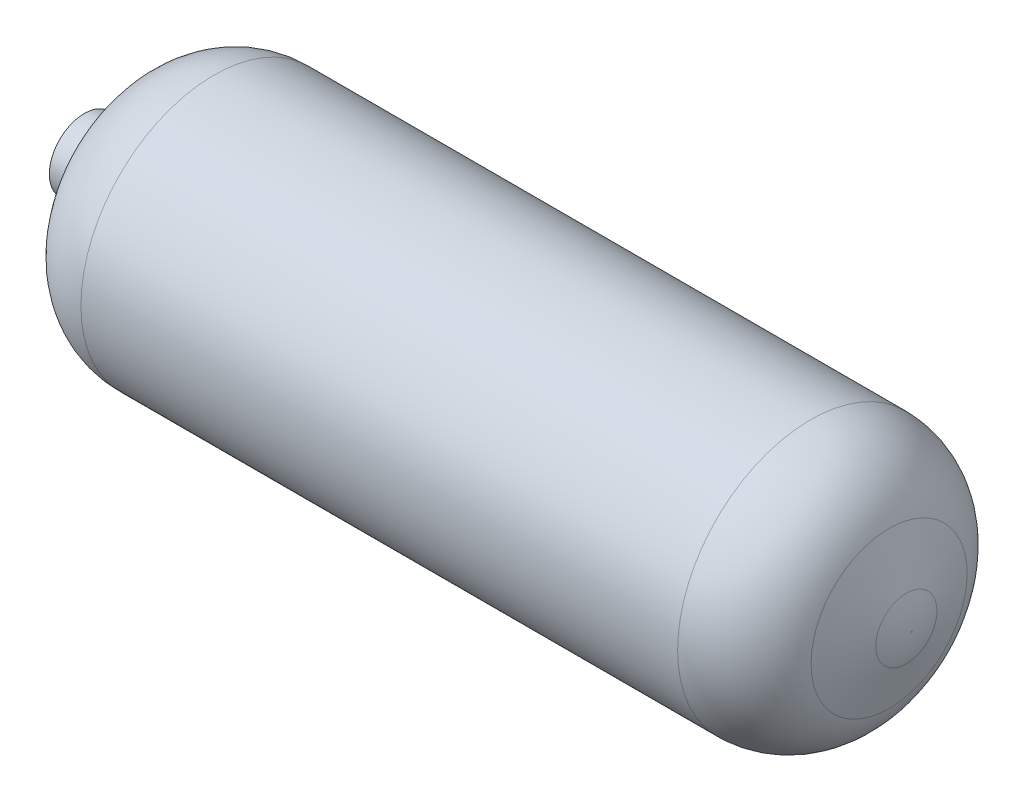
ISO-10303-21;
HEADER;
FILE_DESCRIPTION(('STEP AP214'),'2;1');
FILE_NAME('part.step','',(''),(''),'','','');
FILE_SCHEMA(('AUTOMOTIVE_DESIGN { 1 0 10303 214 1 1 1 1 }'));
ENDSEC;
DATA;
#1=APPLICATION_CONTEXT('core data for automotive mechanical design processes');
#2=APPLICATION_PROTOCOL_DEFINITION('international standard','automotive_design',2000,#1);
#3=PRODUCT_CONTEXT('',#1,'mechanical');
#4=PRODUCT('Part','Part','',(#3));
#5=PRODUCT_RELATED_PRODUCT_CATEGORY('part','',(#4));
#6=PRODUCT_DEFINITION_FORMATION('','',#4);
#7=PRODUCT_DEFINITION_CONTEXT('part definition',#1,'design');
#8=PRODUCT_DEFINITION('design','',#6,#7);
#9=PRODUCT_DEFINITION_SHAPE('','',#8);
#10=(LENGTH_UNIT() NAMED_UNIT(*) SI_UNIT(.MILLI.,.METRE.));
#11=(NAMED_UNIT(*) PLANE_ANGLE_UNIT() SI_UNIT($,.RADIAN.));
#12=(NAMED_UNIT(*) SI_UNIT($,.STERADIAN.) SOLID_ANGLE_UNIT());
#13=UNCERTAINTY_MEASURE_WITH_UNIT(LENGTH_MEASURE(1.E-05),#10,'distance_accuracy_value','');
#14=(GEOMETRIC_REPRESENTATION_CONTEXT(3) GLOBAL_UNCERTAINTY_ASSIGNED_CONTEXT((#13)) GLOBAL_UNIT_ASSIGNED_CONTEXT((#10,
#11,#12)) REPRESENTATION_CONTEXT('',''));
#15=CARTESIAN_POINT('',(0.,0.,0.));
#16=DIRECTION('',(0.,0.,1.));
#17=DIRECTION('',(1.,0.,0.));
#18=AXIS2_PLACEMENT_3D('',#15,#16,#17);
#19=CARTESIAN_POINT('',(-242.271269759622,0.,0.));
#20=DIRECTION('',(1.,0.,0.));
#21=DIRECTION('',(0.,0.,-1.));
#22=AXIS2_PLACEMENT_3D('',#19,#20,#21);
#23=CONICAL_SURFACE('',#22,23.866436766229,1.09955742875643);
#24=CARTESIAN_POINT('',(-226.546463052101,0.,0.));
#25=DIRECTION('',(-1.,0.,0.));
#26=DIRECTION('',(0.,0.,1.));
#27=AXIS2_PLACEMENT_3D('',#24,#25,#26);
#28=CIRCLE('',#27,54.7281076074481);
#29=CARTESIAN_POINT('',(-226.546463052101,0.,54.7281076074481));
#30=VERTEX_POINT('',#29);
#31=EDGE_CURVE('E103',#30,#30,#28,.T.);
#32=ORIENTED_EDGE('',*,*,#31,.T.);
#33=EDGE_LOOP('',(#32));
#34=FACE_BOUND('',#33,.T.);
#35=CARTESIAN_POINT('',(-242.271269759622,0.,0.));
#36=DIRECTION('',(-1.,0.,0.));
#37=DIRECTION('',(0.,0.,1.));
#38=AXIS2_PLACEMENT_3D('',#35,#36,#37);
#39=CIRCLE('',#38,23.866436766229);
#40=CARTESIAN_POINT('',(-242.271269759622,0.,23.866436766229));
#41=VERTEX_POINT('',#40);
#42=EDGE_CURVE('E54',#41,#41,#39,.T.);
#43=ORIENTED_EDGE('',*,*,#42,.F.);
#44=EDGE_LOOP('',(#43));
#45=FACE_BOUND('',#44,.T.);
#46=ADVANCED_FACE('F37',(#34,#45),#23,.T.);
#47=CARTESIAN_POINT('',(-245.166734472183,0.,0.));
#48=DIRECTION('',(-1.,0.,0.));
#49=DIRECTION('',(0.,0.,1.));
#50=AXIS2_PLACEMENT_3D('',#47,#48,#49);
#51=TOROIDAL_SURFACE('',#50,25.3417497253921,3.24965601705214);
#52=CARTESIAN_POINT('',(-245.166734472183,0.,0.));
#53=DIRECTION('',(-1.,0.,0.));
#54=DIRECTION('',(0.,0.,1.));
#55=AXIS2_PLACEMENT_3D('',#52,#53,#54);
#56=CIRCLE('',#55,22.09209370834);
#57=CARTESIAN_POINT('',(-245.166734472183,0.,22.09209370834));
#58=VERTEX_POINT('',#57);
#59=EDGE_CURVE('E78',#58,#58,#56,.T.);
#60=ORIENTED_EDGE('',*,*,#59,.F.);
#61=EDGE_LOOP('',(#60));
#62=FACE_BOUND('',#61,.T.);
#63=ORIENTED_EDGE('',*,*,#42,.T.);
#64=EDGE_LOOP('',(#63));
#65=FACE_BOUND('',#64,.T.);
#66=ADVANCED_FACE('F127',(#62,#65),#51,.F.);
#67=CARTESIAN_POINT('',(-260.719194131512,0.,0.));
#68=DIRECTION('',(-1.,0.,0.));
#69=DIRECTION('',(0.,0.,1.));
#70=AXIS2_PLACEMENT_3D('',#67,#68,#69);
#71=CYLINDRICAL_SURFACE('',#70,22.09209370834);
#72=ORIENTED_EDGE('',*,*,#59,.T.);
#73=EDGE_LOOP('',(#72));
#74=FACE_BOUND('',#73,.T.);
#75=CARTESIAN_POINT('',(-260.719194131512,0.,0.));
#76=DIRECTION('',(-1.,0.,0.));
#77=DIRECTION('',(0.,0.,1.));
#78=AXIS2_PLACEMENT_3D('',#75,#76,#77);
#79=CIRCLE('',#78,22.09209370834);
#80=CARTESIAN_POINT('',(-260.719194131512,0.,22.09209370834));
#81=VERTEX_POINT('',#80);
#82=EDGE_CURVE('E82',#81,#81,#79,.T.);
#83=ORIENTED_EDGE('',*,*,#82,.F.);
#84=EDGE_LOOP('',(#83));
#85=FACE_BOUND('',#84,.T.);
#86=ADVANCED_FACE('F132',(#74,#85),#71,.T.);
#87=CARTESIAN_POINT('',(-260.719194131512,0.,0.));
#88=DIRECTION('',(1.,0.,0.));
#89=DIRECTION('',(0.,0.,-1.));
#90=AXIS2_PLACEMENT_3D('',#87,#88,#89);
#91=PLANE('',#90);
#92=ORIENTED_EDGE('',*,*,#82,.T.);
#93=EDGE_LOOP('',(#92));
#94=FACE_BOUND('',#93,.T.);
#95=ADVANCED_FACE('F277',(#94),#91,.F.);
#96=CARTESIAN_POINT('',(260.719194131512,0.,0.));
#97=DIRECTION('',(-1.,0.,0.));
#98=DIRECTION('',(0.,0.,1.));
#99=AXIS2_PLACEMENT_3D('',#96,#97,#98);
#100=PLANE('',#99);
#101=CARTESIAN_POINT('',(260.719194131512,0.,0.));
#102=DIRECTION('',(-1.,0.,0.));
#103=DIRECTION('',(0.,0.,1.));
#104=AXIS2_PLACEMENT_3D('',#101,#102,#103);
#105=CIRCLE('',#104,0.381787731454405);
#106=CARTESIAN_POINT('',(260.719194131512,0.,0.381787731454405));
#107=VERTEX_POINT('',#106);
#108=EDGE_CURVE('E86',#107,#107,#105,.T.);
#109=ORIENTED_EDGE('',*,*,#108,.F.);
#110=EDGE_LOOP('',(#109));
#111=FACE_BOUND('',#110,.T.);
#112=ADVANCED_FACE('F267',(#111),#100,.F.);
#113=CARTESIAN_POINT('',(205.488959860663,0.,0.));
#114=DIRECTION('',(-1.,0.,0.));
#115=DIRECTION('',(0.,0.,1.));
#116=AXIS2_PLACEMENT_3D('',#113,#114,#115);
#117=DEGENERATE_TOROIDAL_SURFACE('',#116,0.381787731454405,55.23023427085,.T.);
#118=CARTESIAN_POINT('',(257.388403449257,0.,0.));
#119=DIRECTION('',(-1.,0.,0.));
#120=DIRECTION('',(0.,0.,1.));
#121=AXIS2_PLACEMENT_3D('',#118,#119,#120);
#122=CIRCLE('',#121,19.2716403726806);
#123=CARTESIAN_POINT('',(257.388403449257,0.,19.2716403726806));
#124=VERTEX_POINT('',#123);
#125=EDGE_CURVE('E91',#124,#124,#122,.T.);
#126=ORIENTED_EDGE('',*,*,#125,.F.);
#127=EDGE_LOOP('',(#126));
#128=FACE_BOUND('',#127,.T.);
#129=ORIENTED_EDGE('',*,*,#108,.T.);
#130=EDGE_LOOP('',(#129));
#131=FACE_BOUND('',#130,.T.);
#132=ADVANCED_FACE('F257',(#128,#131),#117,.T.);
#133=CARTESIAN_POINT('',(246.499099686017,0.,0.));
#134=DIRECTION('',(-1.,0.,0.));
#135=DIRECTION('',(0.,0.,1.));
#136=AXIS2_PLACEMENT_3D('',#133,#134,#135);
#137=CONICAL_SURFACE('',#136,49.1897565757662,1.22173047639603);
#138=ORIENTED_EDGE('',*,*,#125,.T.);
#139=EDGE_LOOP('',(#138));
#140=FACE_BOUND('',#139,.T.);
#141=CARTESIAN_POINT('',(246.499099686017,0.,0.));
#142=DIRECTION('',(-1.,0.,0.));
#143=DIRECTION('',(0.,0.,1.));
#144=AXIS2_PLACEMENT_3D('',#141,#142,#143);
#145=CIRCLE('',#144,49.1897565757662);
#146=CARTESIAN_POINT('',(246.499099686017,0.,49.1897565757662));
#147=VERTEX_POINT('',#146);
#148=EDGE_CURVE('E94',#147,#147,#145,.T.);
#149=ORIENTED_EDGE('',*,*,#148,.F.);
#150=EDGE_LOOP('',(#149));
#151=FACE_BOUND('',#150,.T.);
#152=ADVANCED_FACE('F123',(#140,#151),#137,.T.);
#153=CARTESIAN_POINT('',(197.041982854532,0.,0.));
#154=DIRECTION('',(-1.,0.,0.));
#155=DIRECTION('',(0.,0.,1.));
#156=AXIS2_PLACEMENT_3D('',#153,#154,#155);
#157=DEGENERATE_TOROIDAL_SURFACE('',#156,31.18883817648,52.63116442281,.T.);
#158=ORIENTED_EDGE('',*,*,#148,.T.);
#159=EDGE_LOOP('',(#158));
#160=FACE_BOUND('',#159,.T.);
#161=CARTESIAN_POINT('',(197.041982854532,0.,0.));
#162=DIRECTION('',(-1.,0.,0.));
#163=DIRECTION('',(0.,0.,1.));
#164=AXIS2_PLACEMENT_3D('',#161,#162,#163);
#165=CIRCLE('',#164,83.82000259929);
#166=CARTESIAN_POINT('',(197.041982854532,0.,83.82000259929));
#167=VERTEX_POINT('',#166);
#168=EDGE_CURVE('E97',#167,#167,#165,.T.);
#169=ORIENTED_EDGE('',*,*,#168,.F.);
#170=EDGE_LOOP('',(#169));
#171=FACE_BOUND('',#170,.T.);
#172=ADVANCED_FACE('F117',(#160,#171),#157,.T.);
#173=CARTESIAN_POINT('',(-260.719194131512,0.,0.));
#174=DIRECTION('',(-1.,0.,0.));
#175=DIRECTION('',(0.,0.,1.));
#176=AXIS2_PLACEMENT_3D('',#173,#174,#175);
#177=CYLINDRICAL_SURFACE('',#176,83.82000259929);
#178=ORIENTED_EDGE('',*,*,#168,.T.);
#179=EDGE_LOOP('',(#178));
#180=FACE_BOUND('',#179,.T.);
#181=CARTESIAN_POINT('',(-179.07280512789,0.,0.));
#182=DIRECTION('',(-1.,0.,0.));
#183=DIRECTION('',(0.,0.,1.));
#184=AXIS2_PLACEMENT_3D('',#181,#182,#183);
#185=CIRCLE('',#184,83.82000259929);
#186=CARTESIAN_POINT('',(-179.07280512789,0.,83.82000259929));
#187=VERTEX_POINT('',#186);
#188=EDGE_CURVE('E100',#187,#187,#185,.T.);
#189=ORIENTED_EDGE('',*,*,#188,.F.);
#190=EDGE_LOOP('',(#189));
#191=FACE_BOUND('',#190,.T.);
#192=ADVANCED_FACE('F112',(#180,#191),#177,.T.);
#193=CARTESIAN_POINT('',(-179.07280512789,0.,0.));
#194=DIRECTION('',(-1.,0.,0.));
#195=DIRECTION('',(0.,0.,1.));
#196=AXIS2_PLACEMENT_3D('',#193,#194,#195);
#197=DEGENERATE_TOROIDAL_SURFACE('',#196,30.53907071447,53.28093188482,.T.);
#198=ORIENTED_EDGE('',*,*,#31,.F.);
#199=EDGE_LOOP('',(#198));
#200=FACE_BOUND('',#199,.T.);
#201=ORIENTED_EDGE('',*,*,#188,.T.);
#202=EDGE_LOOP('',(#201));
#203=FACE_BOUND('',#202,.T.);
#204=ADVANCED_FACE('F109',(#200,#203),#197,.T.);
#205=CLOSED_SHELL('',(#46,#66,#86,#95,#112,#132,#152,#172,#192,#204));
#206=CARTESIAN_POINT('',(-237.292325302457,0.,0.));
#207=DIRECTION('',(1.,0.,0.));
#208=DIRECTION('',(0.,0.,-1.));
#209=AXIS2_PLACEMENT_3D('',#206,#207,#208);
#210=CONICAL_SURFACE('',#209,21.3295378536845,1.09955742875643);
#211=CARTESIAN_POINT('',(-221.567518594936,0.,0.));
#212=DIRECTION('',(1.,0.,0.));
#213=DIRECTION('',(0.,0.,-1.));
#214=AXIS2_PLACEMENT_3D('',#211,#212,#213);
#215=CIRCLE('',#214,52.1912086949035);
#216=CARTESIAN_POINT('',(-221.567518594936,0.,-52.1912086949035));
#217=VERTEX_POINT('',#216);
#218=EDGE_CURVE('E41',#217,#217,#215,.F.);
#219=ORIENTED_EDGE('',*,*,#218,.F.);
#220=EDGE_LOOP('',(#219));
#221=FACE_BOUND('',#220,.T.);
#222=CARTESIAN_POINT('',(-237.292325302457,0.,0.));
#223=DIRECTION('',(-1.,0.,0.));
#224=DIRECTION('',(0.,0.,1.));
#225=AXIS2_PLACEMENT_3D('',#222,#223,#224);
#226=CIRCLE('',#225,21.3295378536845);
#227=CARTESIAN_POINT('',(-237.292325302457,0.,21.3295378536845));
#228=VERTEX_POINT('',#227);
#229=EDGE_CURVE('E70',#228,#228,#226,.T.);
#230=ORIENTED_EDGE('',*,*,#229,.T.);
#231=EDGE_LOOP('',(#230));
#232=FACE_BOUND('',#231,.T.);
#233=ADVANCED_FACE('F137',(#221,#232),#210,.F.);
#234=CARTESIAN_POINT('',(-245.166734472183,0.,0.));
#235=DIRECTION('',(-1.,0.,0.));
#236=DIRECTION('',(0.,0.,1.));
#237=AXIS2_PLACEMENT_3D('',#234,#235,#236);
#238=TOROIDAL_SURFACE('',#237,25.3417497253921,8.83765601705214);
#239=CARTESIAN_POINT('',(-245.166734472183,0.,0.));
#240=DIRECTION('',(-1.,0.,0.));
#241=DIRECTION('',(0.,0.,1.));
#242=AXIS2_PLACEMENT_3D('',#239,#240,#241);
#243=CIRCLE('',#242,16.50409370834);
#244=CARTESIAN_POINT('',(-245.166734472183,0.,16.50409370834));
#245=VERTEX_POINT('',#244);
#246=EDGE_CURVE('E68',#245,#245,#243,.T.);
#247=ORIENTED_EDGE('',*,*,#246,.T.);
#248=EDGE_LOOP('',(#247));
#249=FACE_BOUND('',#248,.T.);
#250=ORIENTED_EDGE('',*,*,#229,.F.);
#251=EDGE_LOOP('',(#250));
#252=FACE_BOUND('',#251,.T.);
#253=ADVANCED_FACE('F140',(#249,#252),#238,.T.);
#254=CARTESIAN_POINT('',(-260.719194131512,0.,0.));
#255=DIRECTION('',(-1.,0.,0.));
#256=DIRECTION('',(0.,0.,1.));
#257=AXIS2_PLACEMENT_3D('',#254,#255,#256);
#258=CYLINDRICAL_SURFACE('',#257,16.50409370834);
#259=ORIENTED_EDGE('',*,*,#246,.F.);
#260=EDGE_LOOP('',(#259));
#261=FACE_BOUND('',#260,.T.);
#262=CARTESIAN_POINT('',(-255.131194131513,0.,0.));
#263=DIRECTION('',(1.,0.,0.));
#264=DIRECTION('',(0.,0.,-1.));
#265=AXIS2_PLACEMENT_3D('',#262,#263,#264);
#266=CIRCLE('',#265,16.50409370834);
#267=CARTESIAN_POINT('',(-255.131194131513,0.,-16.50409370834));
#268=VERTEX_POINT('',#267);
#269=EDGE_CURVE('E65',#268,#268,#266,.F.);
#270=ORIENTED_EDGE('',*,*,#269,.T.);
#271=EDGE_LOOP('',(#270));
#272=FACE_BOUND('',#271,.T.);
#273=ADVANCED_FACE('F145',(#261,#272),#258,.F.);
#274=CARTESIAN_POINT('',(-255.131194131513,0.,0.));
#275=DIRECTION('',(1.,0.,0.));
#276=DIRECTION('',(0.,0.,-1.));
#277=AXIS2_PLACEMENT_3D('',#274,#275,#276);
#278=PLANE('',#277);
#279=ORIENTED_EDGE('',*,*,#269,.F.);
#280=EDGE_LOOP('',(#279));
#281=FACE_BOUND('',#280,.T.);
#282=ADVANCED_FACE('F149',(#281),#278,.T.);
#283=CARTESIAN_POINT('',(255.131194131513,0.,0.));
#284=DIRECTION('',(-1.,0.,0.));
#285=DIRECTION('',(0.,0.,1.));
#286=AXIS2_PLACEMENT_3D('',#283,#284,#285);
#287=PLANE('',#286);
#288=CARTESIAN_POINT('',(255.131194131513,0.,0.));
#289=DIRECTION('',(-1.,0.,0.));
#290=DIRECTION('',(0.,0.,1.));
#291=AXIS2_PLACEMENT_3D('',#288,#289,#290);
#292=CIRCLE('',#291,0.381787731454408);
#293=CARTESIAN_POINT('',(255.131194131513,0.,0.381787731454408));
#294=VERTEX_POINT('',#293);
#295=EDGE_CURVE('E62',#294,#294,#292,.T.);
#296=ORIENTED_EDGE('',*,*,#295,.T.);
#297=EDGE_LOOP('',(#296));
#298=FACE_BOUND('',#297,.T.);
#299=ADVANCED_FACE('F153',(#298),#287,.T.);
#300=CARTESIAN_POINT('',(205.488959860663,0.,0.));
#301=DIRECTION('',(-1.,0.,0.));
#302=DIRECTION('',(0.,0.,1.));
#303=AXIS2_PLACEMENT_3D('',#300,#301,#302);
#304=DEGENERATE_TOROIDAL_SURFACE('',#303,0.381787731454405,49.64223427085,.T.);
#305=CARTESIAN_POINT('',(252.137401084306,0.,0.));
#306=DIRECTION('',(-1.,0.,0.));
#307=DIRECTION('',(0.,0.,1.));
#308=AXIS2_PLACEMENT_3D('',#305,#306,#307);
#309=CIRCLE('',#308,17.3604318117768);
#310=CARTESIAN_POINT('',(252.137401084306,0.,17.3604318117768));
#311=VERTEX_POINT('',#310);
#312=EDGE_CURVE('E59',#311,#311,#309,.T.);
#313=ORIENTED_EDGE('',*,*,#312,.T.);
#314=EDGE_LOOP('',(#313));
#315=FACE_BOUND('',#314,.T.);
#316=ORIENTED_EDGE('',*,*,#295,.F.);
#317=EDGE_LOOP('',(#316));
#318=FACE_BOUND('',#317,.T.);
#319=ADVANCED_FACE('F157',(#315,#318),#304,.F.);
#320=CARTESIAN_POINT('',(241.248097321065,0.,0.));
#321=DIRECTION('',(-1.,0.,0.));
#322=DIRECTION('',(0.,0.,1.));
#323=AXIS2_PLACEMENT_3D('',#320,#321,#322);
#324=CONICAL_SURFACE('',#323,47.2785480148624,1.22173047639603);
#325=ORIENTED_EDGE('',*,*,#312,.F.);
#326=EDGE_LOOP('',(#325));
#327=FACE_BOUND('',#326,.T.);
#328=CARTESIAN_POINT('',(241.248097321065,0.,0.));
#329=DIRECTION('',(-1.,0.,0.));
#330=DIRECTION('',(0.,0.,1.));
#331=AXIS2_PLACEMENT_3D('',#328,#329,#330);
#332=CIRCLE('',#331,47.2785480148624);
#333=CARTESIAN_POINT('',(241.248097321065,0.,47.2785480148624));
#334=VERTEX_POINT('',#333);
#335=EDGE_CURVE('E51',#334,#334,#332,.T.);
#336=ORIENTED_EDGE('',*,*,#335,.T.);
#337=EDGE_LOOP('',(#336));
#338=FACE_BOUND('',#337,.T.);
#339=ADVANCED_FACE('F161',(#327,#338),#324,.F.);
#340=CARTESIAN_POINT('',(197.041982854532,0.,0.));
#341=DIRECTION('',(-1.,0.,0.));
#342=DIRECTION('',(0.,0.,1.));
#343=AXIS2_PLACEMENT_3D('',#340,#341,#342);
#344=DEGENERATE_TOROIDAL_SURFACE('',#343,31.18883817648,47.04316442281,.T.);
#345=ORIENTED_EDGE('',*,*,#335,.F.);
#346=EDGE_LOOP('',(#345));
#347=FACE_BOUND('',#346,.T.);
#348=CARTESIAN_POINT('',(197.041982854532,0.,0.));
#349=DIRECTION('',(-1.,0.,0.));
#350=DIRECTION('',(0.,0.,1.));
#351=AXIS2_PLACEMENT_3D('',#348,#349,#350);
#352=CIRCLE('',#351,78.23200259929);
#353=CARTESIAN_POINT('',(197.041982854532,0.,78.23200259929));
#354=VERTEX_POINT('',#353);
#355=EDGE_CURVE('E46',#354,#354,#352,.T.);
#356=ORIENTED_EDGE('',*,*,#355,.T.);
#357=EDGE_LOOP('',(#356));
#358=FACE_BOUND('',#357,.T.);
#359=ADVANCED_FACE('F165',(#347,#358),#344,.F.);
#360=CARTESIAN_POINT('',(-260.719194131512,0.,0.));
#361=DIRECTION('',(-1.,0.,0.));
#362=DIRECTION('',(0.,0.,1.));
#363=AXIS2_PLACEMENT_3D('',#360,#361,#362);
#364=CYLINDRICAL_SURFACE('',#363,78.23200259929);
#365=ORIENTED_EDGE('',*,*,#355,.F.);
#366=EDGE_LOOP('',(#365));
#367=FACE_BOUND('',#366,.T.);
#368=CARTESIAN_POINT('',(-179.07280512789,0.,0.));
#369=DIRECTION('',(-1.,0.,0.));
#370=DIRECTION('',(0.,0.,1.));
#371=AXIS2_PLACEMENT_3D('',#368,#369,#370);
#372=CIRCLE('',#371,78.23200259929);
#373=CARTESIAN_POINT('',(-179.07280512789,0.,78.23200259929));
#374=VERTEX_POINT('',#373);
#375=EDGE_CURVE('E10',#374,#374,#372,.T.);
#376=ORIENTED_EDGE('',*,*,#375,.T.);
#377=EDGE_LOOP('',(#376));
#378=FACE_BOUND('',#377,.T.);
#379=ADVANCED_FACE('F168',(#367,#378),#364,.F.);
#380=CARTESIAN_POINT('',(-179.07280512789,0.,0.));
#381=DIRECTION('',(-1.,0.,0.));
#382=DIRECTION('',(0.,0.,1.));
#383=AXIS2_PLACEMENT_3D('',#380,#381,#382);
#384=DEGENERATE_TOROIDAL_SURFACE('',#383,30.53907071447,47.69293188482,.T.);
#385=ORIENTED_EDGE('',*,*,#218,.T.);
#386=EDGE_LOOP('',(#385));
#387=FACE_BOUND('',#386,.T.);
#388=ORIENTED_EDGE('',*,*,#375,.F.);
#389=EDGE_LOOP('',(#388));
#390=FACE_BOUND('',#389,.T.);
#391=ADVANCED_FACE('F39',(#387,#390),#384,.F.);
#392=CLOSED_SHELL('',(#233,#253,#273,#282,#299,#319,#339,#359,#379,#391));
#393=ORIENTED_CLOSED_SHELL('',*,#392,.T.);
#394=BREP_WITH_VOIDS('B2',#205,(#393));
#395=ADVANCED_BREP_SHAPE_REPRESENTATION('',(#18,#394),#14);
#396=SHAPE_DEFINITION_REPRESENTATION(#9,#395);
ENDSEC;
END-ISO-10303-21;
